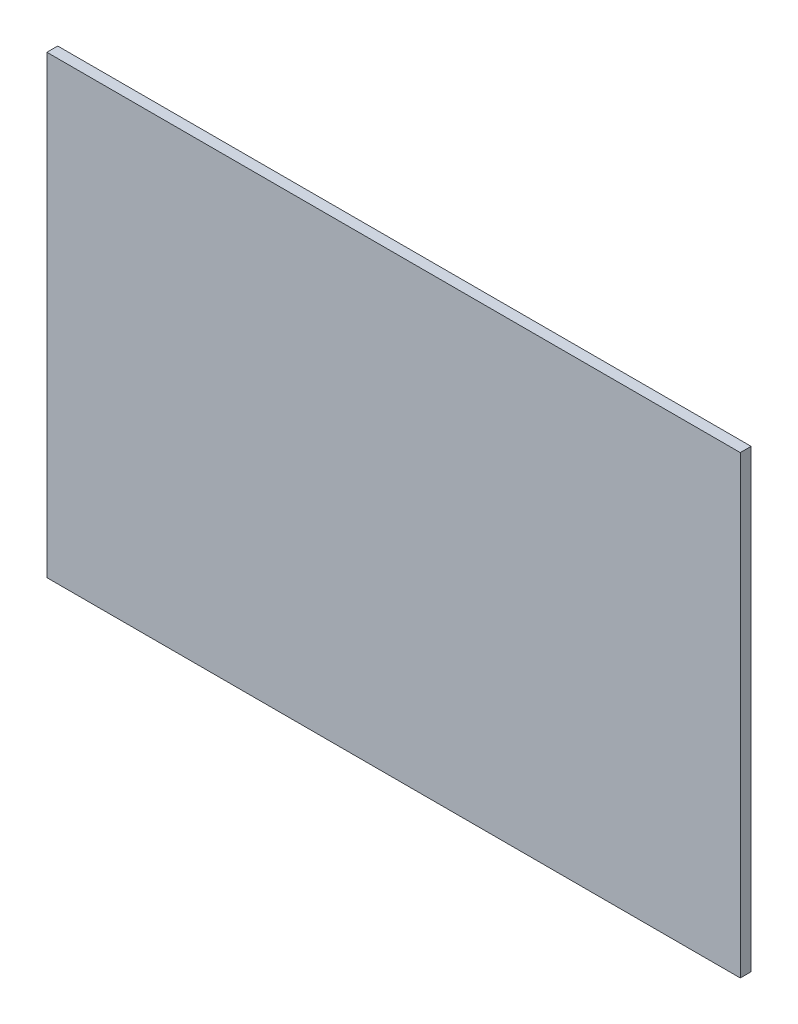
ISO-10303-21;
HEADER;
FILE_DESCRIPTION(('STEP AP214'),'2;1');
FILE_NAME('part.step','',(''),(''),'','','');
FILE_SCHEMA(('AUTOMOTIVE_DESIGN { 1 0 10303 214 1 1 1 1 }'));
ENDSEC;
DATA;
#1=APPLICATION_CONTEXT('core data for automotive mechanical design processes');
#2=APPLICATION_PROTOCOL_DEFINITION('international standard','automotive_design',2000,#1);
#3=PRODUCT_CONTEXT('',#1,'mechanical');
#4=PRODUCT('Part','Part','',(#3));
#5=PRODUCT_RELATED_PRODUCT_CATEGORY('part','',(#4));
#6=PRODUCT_DEFINITION_FORMATION('','',#4);
#7=PRODUCT_DEFINITION_CONTEXT('part definition',#1,'design');
#8=PRODUCT_DEFINITION('design','',#6,#7);
#9=PRODUCT_DEFINITION_SHAPE('','',#8);
#10=(LENGTH_UNIT() NAMED_UNIT(*) SI_UNIT(.MILLI.,.METRE.));
#11=(NAMED_UNIT(*) PLANE_ANGLE_UNIT() SI_UNIT($,.RADIAN.));
#12=(NAMED_UNIT(*) SI_UNIT($,.STERADIAN.) SOLID_ANGLE_UNIT());
#13=UNCERTAINTY_MEASURE_WITH_UNIT(LENGTH_MEASURE(1.E-05),#10,'distance_accuracy_value','');
#14=(GEOMETRIC_REPRESENTATION_CONTEXT(3) GLOBAL_UNCERTAINTY_ASSIGNED_CONTEXT((#13)) GLOBAL_UNIT_ASSIGNED_CONTEXT((#10,
#11,#12)) REPRESENTATION_CONTEXT('',''));
#15=CARTESIAN_POINT('',(0.,0.,0.));
#16=DIRECTION('',(0.,0.,1.));
#17=DIRECTION('',(1.,0.,0.));
#18=AXIS2_PLACEMENT_3D('',#15,#16,#17);
#19=CARTESIAN_POINT('',(160.,105.,-5.));
#20=DIRECTION('',(1.,0.,0.));
#21=DIRECTION('',(0.,1.,0.));
#22=AXIS2_PLACEMENT_3D('',#19,#20,#21);
#23=PLANE('',#22);
#24=DIRECTION('',(0.,1.,0.));
#25=VECTOR('',#24,1.);
#26=CARTESIAN_POINT('',(160.,105.,0.));
#27=LINE('',#26,#25);
#28=CARTESIAN_POINT('',(160.,-105.,0.));
#29=VERTEX_POINT('',#28);
#30=CARTESIAN_POINT('',(160.,105.,0.));
#31=VERTEX_POINT('',#30);
#32=EDGE_CURVE('E103',#29,#31,#27,.T.);
#33=ORIENTED_EDGE('',*,*,#32,.F.);
#34=DIRECTION('',(0.,0.,1.));
#35=VECTOR('',#34,1.);
#36=CARTESIAN_POINT('',(160.,-105.,-5.));
#37=LINE('',#36,#35);
#38=CARTESIAN_POINT('',(160.,-105.,-5.));
#39=VERTEX_POINT('',#38);
#40=EDGE_CURVE('E11',#39,#29,#37,.T.);
#41=ORIENTED_EDGE('',*,*,#40,.F.);
#42=DIRECTION('',(0.,1.,0.));
#43=VECTOR('',#42,1.);
#44=CARTESIAN_POINT('',(160.,105.,-5.));
#45=LINE('',#44,#43);
#46=CARTESIAN_POINT('',(160.,105.,-5.));
#47=VERTEX_POINT('',#46);
#48=EDGE_CURVE('E97',#39,#47,#45,.T.);
#49=ORIENTED_EDGE('',*,*,#48,.T.);
#50=DIRECTION('',(0.,0.,1.));
#51=VECTOR('',#50,1.);
#52=CARTESIAN_POINT('',(160.,105.,-5.));
#53=LINE('',#52,#51);
#54=EDGE_CURVE('E42',#47,#31,#53,.T.);
#55=ORIENTED_EDGE('',*,*,#54,.T.);
#56=EDGE_LOOP('',(#33,#41,#49,#55));
#57=FACE_BOUND('',#56,.T.);
#58=ADVANCED_FACE('F39',(#57),#23,.T.);
#59=CARTESIAN_POINT('',(-160.,-105.,-5.));
#60=DIRECTION('',(0.,-1.,0.));
#61=DIRECTION('',(0.,0.,-1.));
#62=AXIS2_PLACEMENT_3D('',#59,#60,#61);
#63=PLANE('',#62);
#64=DIRECTION('',(1.,0.,0.));
#65=VECTOR('',#64,1.);
#66=CARTESIAN_POINT('',(-160.,-105.,0.));
#67=LINE('',#66,#65);
#68=CARTESIAN_POINT('',(-160.,-105.,0.));
#69=VERTEX_POINT('',#68);
#70=EDGE_CURVE('E99',#69,#29,#67,.T.);
#71=ORIENTED_EDGE('',*,*,#70,.F.);
#72=DIRECTION('',(0.,0.,1.));
#73=VECTOR('',#72,1.);
#74=CARTESIAN_POINT('',(-160.,-105.,-5.));
#75=LINE('',#74,#73);
#76=CARTESIAN_POINT('',(-160.,-105.,-5.));
#77=VERTEX_POINT('',#76);
#78=EDGE_CURVE('E48',#77,#69,#75,.T.);
#79=ORIENTED_EDGE('',*,*,#78,.F.);
#80=DIRECTION('',(1.,0.,0.));
#81=VECTOR('',#80,1.);
#82=CARTESIAN_POINT('',(-160.,-105.,-5.));
#83=LINE('',#82,#81);
#84=EDGE_CURVE('E94',#77,#39,#83,.T.);
#85=ORIENTED_EDGE('',*,*,#84,.T.);
#86=ORIENTED_EDGE('',*,*,#40,.T.);
#87=EDGE_LOOP('',(#71,#79,#85,#86));
#88=FACE_BOUND('',#87,.T.);
#89=ADVANCED_FACE('F113',(#88),#63,.T.);
#90=CARTESIAN_POINT('',(-160.,105.,-5.));
#91=DIRECTION('',(-1.,0.,0.));
#92=DIRECTION('',(0.,0.,1.));
#93=AXIS2_PLACEMENT_3D('',#90,#91,#92);
#94=PLANE('',#93);
#95=DIRECTION('',(0.,-1.,0.));
#96=VECTOR('',#95,1.);
#97=CARTESIAN_POINT('',(-160.,105.,0.));
#98=LINE('',#97,#96);
#99=CARTESIAN_POINT('',(-160.,105.,0.));
#100=VERTEX_POINT('',#99);
#101=EDGE_CURVE('E89',#100,#69,#98,.T.);
#102=ORIENTED_EDGE('',*,*,#101,.F.);
#103=DIRECTION('',(0.,0.,1.));
#104=VECTOR('',#103,1.);
#105=CARTESIAN_POINT('',(-160.,105.,-5.));
#106=LINE('',#105,#104);
#107=CARTESIAN_POINT('',(-160.,105.,-5.));
#108=VERTEX_POINT('',#107);
#109=EDGE_CURVE('E84',#108,#100,#106,.T.);
#110=ORIENTED_EDGE('',*,*,#109,.F.);
#111=DIRECTION('',(0.,-1.,0.));
#112=VECTOR('',#111,1.);
#113=CARTESIAN_POINT('',(-160.,105.,-5.));
#114=LINE('',#113,#112);
#115=EDGE_CURVE('E87',#108,#77,#114,.T.);
#116=ORIENTED_EDGE('',*,*,#115,.T.);
#117=ORIENTED_EDGE('',*,*,#78,.T.);
#118=EDGE_LOOP('',(#102,#110,#116,#117));
#119=FACE_BOUND('',#118,.T.);
#120=ADVANCED_FACE('F86',(#119),#94,.T.);
#121=CARTESIAN_POINT('',(-160.,105.,-5.));
#122=DIRECTION('',(0.,1.,0.));
#123=DIRECTION('',(0.,0.,1.));
#124=AXIS2_PLACEMENT_3D('',#121,#122,#123);
#125=PLANE('',#124);
#126=DIRECTION('',(-1.,0.,0.));
#127=VECTOR('',#126,1.);
#128=CARTESIAN_POINT('',(-160.,105.,0.));
#129=LINE('',#128,#127);
#130=EDGE_CURVE('E106',#31,#100,#129,.T.);
#131=ORIENTED_EDGE('',*,*,#130,.F.);
#132=ORIENTED_EDGE('',*,*,#54,.F.);
#133=DIRECTION('',(-1.,0.,0.));
#134=VECTOR('',#133,1.);
#135=CARTESIAN_POINT('',(-160.,105.,-5.));
#136=LINE('',#135,#134);
#137=EDGE_CURVE('E93',#47,#108,#136,.T.);
#138=ORIENTED_EDGE('',*,*,#137,.T.);
#139=ORIENTED_EDGE('',*,*,#109,.T.);
#140=EDGE_LOOP('',(#131,#132,#138,#139));
#141=FACE_BOUND('',#140,.T.);
#142=ADVANCED_FACE('F96',(#141),#125,.T.);
#143=CARTESIAN_POINT('',(0.,0.,-5.));
#144=DIRECTION('',(0.,0.,1.));
#145=DIRECTION('',(1.,0.,0.));
#146=AXIS2_PLACEMENT_3D('',#143,#144,#145);
#147=PLANE('',#146);
#148=ORIENTED_EDGE('',*,*,#48,.F.);
#149=ORIENTED_EDGE('',*,*,#84,.F.);
#150=ORIENTED_EDGE('',*,*,#115,.F.);
#151=ORIENTED_EDGE('',*,*,#137,.F.);
#152=EDGE_LOOP('',(#148,#149,#150,#151));
#153=FACE_BOUND('',#152,.T.);
#154=ADVANCED_FACE('F92',(#153),#147,.F.);
#155=CARTESIAN_POINT('',(0.,0.,0.));
#156=DIRECTION('',(0.,0.,1.));
#157=DIRECTION('',(1.,0.,0.));
#158=AXIS2_PLACEMENT_3D('',#155,#156,#157);
#159=PLANE('',#158);
#160=ORIENTED_EDGE('',*,*,#32,.T.);
#161=ORIENTED_EDGE('',*,*,#130,.T.);
#162=ORIENTED_EDGE('',*,*,#101,.T.);
#163=ORIENTED_EDGE('',*,*,#70,.T.);
#164=EDGE_LOOP('',(#160,#161,#162,#163));
#165=FACE_BOUND('',#164,.T.);
#166=ADVANCED_FACE('F112',(#165),#159,.T.);
#167=CLOSED_SHELL('',(#58,#89,#120,#142,#154,#166));
#168=MANIFOLD_SOLID_BREP('B2',#167);
#169=ADVANCED_BREP_SHAPE_REPRESENTATION('',(#18,#168),#14);
#170=SHAPE_DEFINITION_REPRESENTATION(#9,#169);
ENDSEC;
END-ISO-10303-21;
